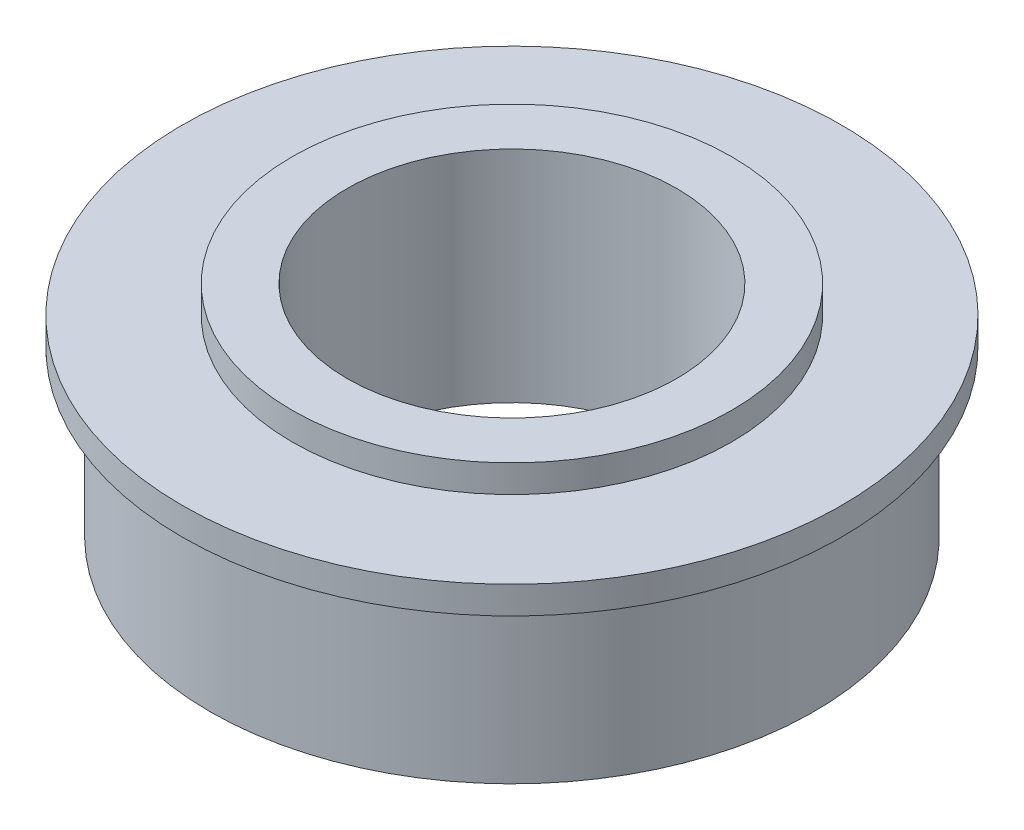
ISO-10303-21;
HEADER;
FILE_DESCRIPTION(('STEP AP214'),'2;1');
FILE_NAME('part.step','',(''),(''),'','','');
FILE_SCHEMA(('AUTOMOTIVE_DESIGN { 1 0 10303 214 1 1 1 1 }'));
ENDSEC;
DATA;
#1=APPLICATION_CONTEXT('core data for automotive mechanical design processes');
#2=APPLICATION_PROTOCOL_DEFINITION('international standard','automotive_design',2000,#1);
#3=PRODUCT_CONTEXT('',#1,'mechanical');
#4=PRODUCT('Part','Part','',(#3));
#5=PRODUCT_RELATED_PRODUCT_CATEGORY('part','',(#4));
#6=PRODUCT_DEFINITION_FORMATION('','',#4);
#7=PRODUCT_DEFINITION_CONTEXT('part definition',#1,'design');
#8=PRODUCT_DEFINITION('design','',#6,#7);
#9=PRODUCT_DEFINITION_SHAPE('','',#8);
#10=(LENGTH_UNIT() NAMED_UNIT(*) SI_UNIT(.MILLI.,.METRE.));
#11=(NAMED_UNIT(*) PLANE_ANGLE_UNIT() SI_UNIT($,.RADIAN.));
#12=(NAMED_UNIT(*) SI_UNIT($,.STERADIAN.) SOLID_ANGLE_UNIT());
#13=UNCERTAINTY_MEASURE_WITH_UNIT(LENGTH_MEASURE(1.E-05),#10,'distance_accuracy_value','');
#14=(GEOMETRIC_REPRESENTATION_CONTEXT(3) GLOBAL_UNCERTAINTY_ASSIGNED_CONTEXT((#13)) GLOBAL_UNIT_ASSIGNED_CONTEXT((#10,
#11,#12)) REPRESENTATION_CONTEXT('',''));
#15=CARTESIAN_POINT('',(0.,0.,0.));
#16=DIRECTION('',(0.,0.,1.));
#17=DIRECTION('',(1.,0.,0.));
#18=AXIS2_PLACEMENT_3D('',#15,#16,#17);
#19=CARTESIAN_POINT('',(0.,0.,0.));
#20=DIRECTION('',(0.,1.,0.));
#21=DIRECTION('',(0.,0.,1.));
#22=AXIS2_PLACEMENT_3D('',#19,#20,#21);
#23=CYLINDRICAL_SURFACE('',#22,9.525);
#24=CARTESIAN_POINT('',(0.,-11.1125,0.));
#25=DIRECTION('',(0.,1.,0.));
#26=DIRECTION('',(0.,0.,1.));
#27=AXIS2_PLACEMENT_3D('',#24,#25,#26);
#28=CIRCLE('',#27,9.525);
#29=CARTESIAN_POINT('',(0.,-11.1125,9.525));
#30=VERTEX_POINT('',#29);
#31=EDGE_CURVE('E63',#30,#30,#28,.T.);
#32=ORIENTED_EDGE('',*,*,#31,.F.);
#33=EDGE_LOOP('',(#32));
#34=FACE_BOUND('',#33,.T.);
#35=CARTESIAN_POINT('',(0.,1.5875,0.));
#36=DIRECTION('',(0.,1.,0.));
#37=DIRECTION('',(0.,0.,1.));
#38=AXIS2_PLACEMENT_3D('',#35,#36,#37);
#39=CIRCLE('',#38,9.525);
#40=CARTESIAN_POINT('',(0.,1.5875,9.525));
#41=VERTEX_POINT('',#40);
#42=EDGE_CURVE('E10',#41,#41,#39,.T.);
#43=ORIENTED_EDGE('',*,*,#42,.T.);
#44=EDGE_LOOP('',(#43));
#45=FACE_BOUND('',#44,.T.);
#46=ADVANCED_FACE('F35',(#34,#45),#23,.F.);
#47=CARTESIAN_POINT('',(9.525,1.5875,0.));
#48=DIRECTION('',(0.,-1.,0.));
#49=DIRECTION('',(0.,0.,-1.));
#50=AXIS2_PLACEMENT_3D('',#47,#48,#49);
#51=PLANE('',#50);
#52=ORIENTED_EDGE('',*,*,#42,.F.);
#53=EDGE_LOOP('',(#52));
#54=FACE_BOUND('',#53,.T.);
#55=CARTESIAN_POINT('',(0.,1.5875,0.));
#56=DIRECTION('',(0.,1.,0.));
#57=DIRECTION('',(0.,0.,1.));
#58=AXIS2_PLACEMENT_3D('',#55,#56,#57);
#59=CIRCLE('',#58,12.7);
#60=CARTESIAN_POINT('',(0.,1.5875,12.7));
#61=VERTEX_POINT('',#60);
#62=EDGE_CURVE('E41',#61,#61,#59,.T.);
#63=ORIENTED_EDGE('',*,*,#62,.T.);
#64=EDGE_LOOP('',(#63));
#65=FACE_BOUND('',#64,.T.);
#66=ADVANCED_FACE('F70',(#54,#65),#51,.F.);
#67=CARTESIAN_POINT('',(0.,0.,0.));
#68=DIRECTION('',(0.,1.,0.));
#69=DIRECTION('',(0.,0.,1.));
#70=AXIS2_PLACEMENT_3D('',#67,#68,#69);
#71=CYLINDRICAL_SURFACE('',#70,12.7);
#72=ORIENTED_EDGE('',*,*,#62,.F.);
#73=EDGE_LOOP('',(#72));
#74=FACE_BOUND('',#73,.T.);
#75=CARTESIAN_POINT('',(0.,0.,0.));
#76=DIRECTION('',(0.,1.,0.));
#77=DIRECTION('',(0.,0.,1.));
#78=AXIS2_PLACEMENT_3D('',#75,#76,#77);
#79=CIRCLE('',#78,12.7);
#80=CARTESIAN_POINT('',(0.,0.,12.7));
#81=VERTEX_POINT('',#80);
#82=EDGE_CURVE('E45',#81,#81,#79,.T.);
#83=ORIENTED_EDGE('',*,*,#82,.T.);
#84=EDGE_LOOP('',(#83));
#85=FACE_BOUND('',#84,.T.);
#86=ADVANCED_FACE('F74',(#74,#85),#71,.T.);
#87=CARTESIAN_POINT('',(12.7,0.,0.));
#88=DIRECTION('',(0.,-1.,0.));
#89=DIRECTION('',(0.,0.,-1.));
#90=AXIS2_PLACEMENT_3D('',#87,#88,#89);
#91=PLANE('',#90);
#92=ORIENTED_EDGE('',*,*,#82,.F.);
#93=EDGE_LOOP('',(#92));
#94=FACE_BOUND('',#93,.T.);
#95=CARTESIAN_POINT('',(0.,0.,0.));
#96=DIRECTION('',(0.,1.,0.));
#97=DIRECTION('',(0.,0.,1.));
#98=AXIS2_PLACEMENT_3D('',#95,#96,#97);
#99=CIRCLE('',#98,19.05);
#100=CARTESIAN_POINT('',(0.,0.,19.05));
#101=VERTEX_POINT('',#100);
#102=EDGE_CURVE('E49',#101,#101,#99,.T.);
#103=ORIENTED_EDGE('',*,*,#102,.T.);
#104=EDGE_LOOP('',(#103));
#105=FACE_BOUND('',#104,.T.);
#106=ADVANCED_FACE('F79',(#94,#105),#91,.F.);
#107=CARTESIAN_POINT('',(0.,0.,0.));
#108=DIRECTION('',(0.,1.,0.));
#109=DIRECTION('',(0.,0.,1.));
#110=AXIS2_PLACEMENT_3D('',#107,#108,#109);
#111=CYLINDRICAL_SURFACE('',#110,19.05);
#112=ORIENTED_EDGE('',*,*,#102,.F.);
#113=EDGE_LOOP('',(#112));
#114=FACE_BOUND('',#113,.T.);
#115=CARTESIAN_POINT('',(0.,-1.58749999999998,0.));
#116=DIRECTION('',(0.,1.,0.));
#117=DIRECTION('',(0.,0.,1.));
#118=AXIS2_PLACEMENT_3D('',#115,#116,#117);
#119=CIRCLE('',#118,19.05);
#120=CARTESIAN_POINT('',(0.,-1.58749999999998,19.05));
#121=VERTEX_POINT('',#120);
#122=EDGE_CURVE('E54',#121,#121,#119,.T.);
#123=ORIENTED_EDGE('',*,*,#122,.T.);
#124=EDGE_LOOP('',(#123));
#125=FACE_BOUND('',#124,.T.);
#126=ADVANCED_FACE('F85',(#114,#125),#111,.T.);
#127=CARTESIAN_POINT('',(19.05,-1.58749999999998,0.));
#128=DIRECTION('',(0.,1.,0.));
#129=DIRECTION('',(0.,0.,1.));
#130=AXIS2_PLACEMENT_3D('',#127,#128,#129);
#131=PLANE('',#130);
#132=ORIENTED_EDGE('',*,*,#122,.F.);
#133=EDGE_LOOP('',(#132));
#134=FACE_BOUND('',#133,.T.);
#135=CARTESIAN_POINT('',(0.,-1.58749999999998,0.));
#136=DIRECTION('',(0.,1.,0.));
#137=DIRECTION('',(0.,0.,1.));
#138=AXIS2_PLACEMENT_3D('',#135,#136,#137);
#139=CIRCLE('',#138,17.4625);
#140=CARTESIAN_POINT('',(0.,-1.58749999999998,17.4625));
#141=VERTEX_POINT('',#140);
#142=EDGE_CURVE('E57',#141,#141,#139,.T.);
#143=ORIENTED_EDGE('',*,*,#142,.T.);
#144=EDGE_LOOP('',(#143));
#145=FACE_BOUND('',#144,.T.);
#146=ADVANCED_FACE('F89',(#134,#145),#131,.F.);
#147=CARTESIAN_POINT('',(0.,0.,0.));
#148=DIRECTION('',(0.,1.,0.));
#149=DIRECTION('',(0.,0.,1.));
#150=AXIS2_PLACEMENT_3D('',#147,#148,#149);
#151=CYLINDRICAL_SURFACE('',#150,17.4625);
#152=ORIENTED_EDGE('',*,*,#142,.F.);
#153=EDGE_LOOP('',(#152));
#154=FACE_BOUND('',#153,.T.);
#155=CARTESIAN_POINT('',(0.,-11.1125,0.));
#156=DIRECTION('',(0.,1.,0.));
#157=DIRECTION('',(0.,0.,1.));
#158=AXIS2_PLACEMENT_3D('',#155,#156,#157);
#159=CIRCLE('',#158,17.4625);
#160=CARTESIAN_POINT('',(0.,-11.1125,17.4625));
#161=VERTEX_POINT('',#160);
#162=EDGE_CURVE('E60',#161,#161,#159,.T.);
#163=ORIENTED_EDGE('',*,*,#162,.T.);
#164=EDGE_LOOP('',(#163));
#165=FACE_BOUND('',#164,.T.);
#166=ADVANCED_FACE('F93',(#154,#165),#151,.T.);
#167=CARTESIAN_POINT('',(17.4625,-11.1125,0.));
#168=DIRECTION('',(0.,1.,0.));
#169=DIRECTION('',(0.,0.,1.));
#170=AXIS2_PLACEMENT_3D('',#167,#168,#169);
#171=PLANE('',#170);
#172=ORIENTED_EDGE('',*,*,#162,.F.);
#173=EDGE_LOOP('',(#172));
#174=FACE_BOUND('',#173,.T.);
#175=ORIENTED_EDGE('',*,*,#31,.T.);
#176=EDGE_LOOP('',(#175));
#177=FACE_BOUND('',#176,.T.);
#178=ADVANCED_FACE('F67',(#174,#177),#171,.F.);
#179=CLOSED_SHELL('',(#46,#66,#86,#106,#126,#146,#166,#178));
#180=MANIFOLD_SOLID_BREP('B2',#179);
#181=ADVANCED_BREP_SHAPE_REPRESENTATION('',(#18,#180),#14);
#182=SHAPE_DEFINITION_REPRESENTATION(#9,#181);
ENDSEC;
END-ISO-10303-21;
